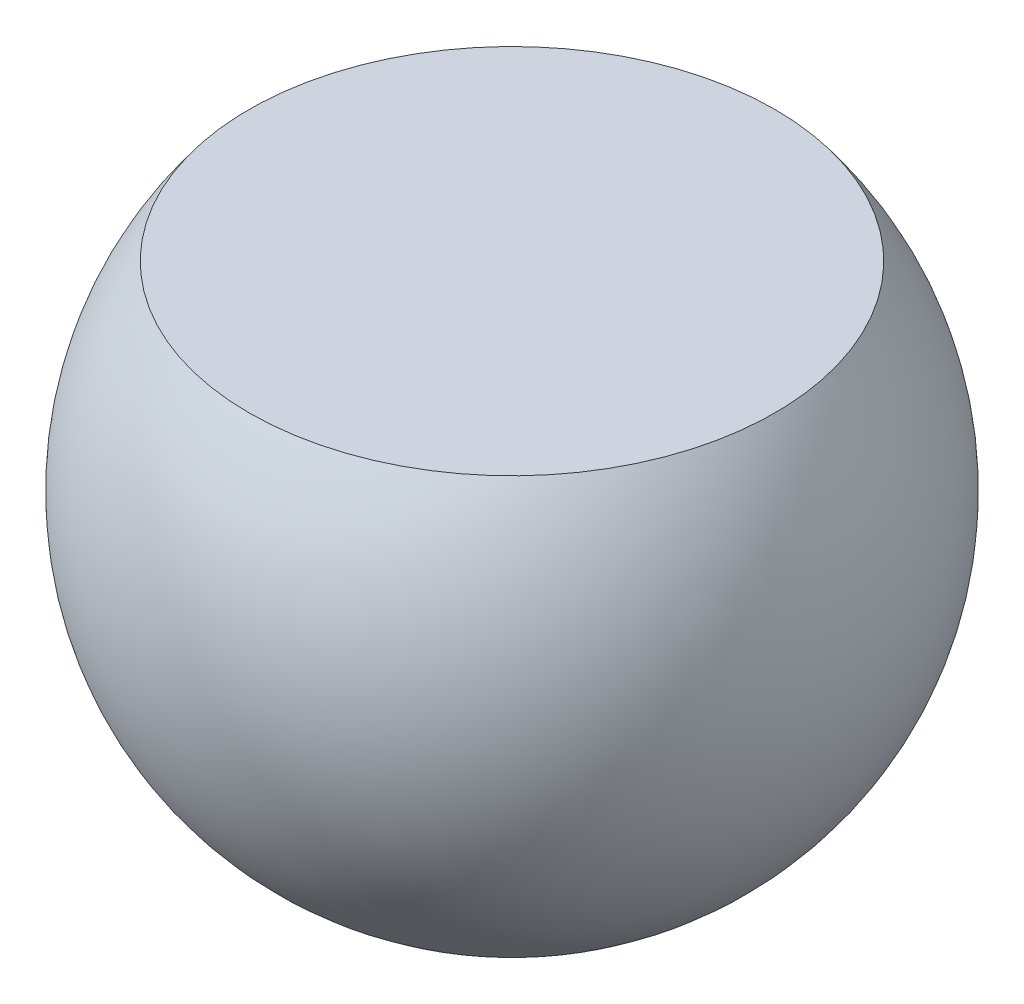
ISO-10303-21;
HEADER;
FILE_DESCRIPTION(('STEP AP214'),'2;1');
FILE_NAME('part.step','',(''),(''),'','','');
FILE_SCHEMA(('AUTOMOTIVE_DESIGN { 1 0 10303 214 1 1 1 1 }'));
ENDSEC;
DATA;
#1=APPLICATION_CONTEXT('core data for automotive mechanical design processes');
#2=APPLICATION_PROTOCOL_DEFINITION('international standard','automotive_design',2000,#1);
#3=PRODUCT_CONTEXT('',#1,'mechanical');
#4=PRODUCT('Part','Part','',(#3));
#5=PRODUCT_RELATED_PRODUCT_CATEGORY('part','',(#4));
#6=PRODUCT_DEFINITION_FORMATION('','',#4);
#7=PRODUCT_DEFINITION_CONTEXT('part definition',#1,'design');
#8=PRODUCT_DEFINITION('design','',#6,#7);
#9=PRODUCT_DEFINITION_SHAPE('','',#8);
#10=(LENGTH_UNIT() NAMED_UNIT(*) SI_UNIT(.MILLI.,.METRE.));
#11=(NAMED_UNIT(*) PLANE_ANGLE_UNIT() SI_UNIT($,.RADIAN.));
#12=(NAMED_UNIT(*) SI_UNIT($,.STERADIAN.) SOLID_ANGLE_UNIT());
#13=UNCERTAINTY_MEASURE_WITH_UNIT(LENGTH_MEASURE(1.E-05),#10,'distance_accuracy_value','');
#14=(GEOMETRIC_REPRESENTATION_CONTEXT(3) GLOBAL_UNCERTAINTY_ASSIGNED_CONTEXT((#13)) GLOBAL_UNIT_ASSIGNED_CONTEXT((#10,
#11,#12)) REPRESENTATION_CONTEXT('',''));
#15=CARTESIAN_POINT('',(0.,0.,0.));
#16=DIRECTION('',(0.,0.,1.));
#17=DIRECTION('',(1.,0.,0.));
#18=AXIS2_PLACEMENT_3D('',#15,#16,#17);
#19=CARTESIAN_POINT('',(0.,0.,0.));
#20=DIRECTION('',(0.,0.,-1.));
#21=DIRECTION('',(1.,0.,0.));
#22=AXIS2_PLACEMENT_3D('',#19,#20,#21);
#23=SPHERICAL_SURFACE('',#22,1.682500064);
#24=CARTESIAN_POINT('',(0.,0.,0.));
#25=DIRECTION('',(0.,-1.,0.));
#26=DIRECTION('',(0.,0.,-1.));
#27=AXIS2_PLACEMENT_3D('',#24,#25,#26);
#28=SPHERICAL_SURFACE('',#27,1.682500064);
#29=CARTESIAN_POINT('',(0.,1.016,0.));
#30=DIRECTION('',(0.,-1.,0.));
#31=DIRECTION('',(0.,0.,-1.));
#32=AXIS2_PLACEMENT_3D('',#29,#30,#31);
#33=CIRCLE('',#32,1.34110046803362);
#34=CARTESIAN_POINT('',(0.,1.016,-1.34110046803362));
#35=VERTEX_POINT('',#34);
#36=EDGE_CURVE('E10',#35,#35,#33,.F.);
#37=ORIENTED_EDGE('',*,*,#36,.F.);
#38=EDGE_LOOP('',(#37));
#39=FACE_BOUND('',#38,.T.);
#40=ADVANCED_FACE('F32',(#39),#28,.T.);
#41=CARTESIAN_POINT('',(0.,1.016,0.));
#42=DIRECTION('',(0.,-1.,0.));
#43=DIRECTION('',(0.,0.,-1.));
#44=AXIS2_PLACEMENT_3D('',#41,#42,#43);
#45=PLANE('',#44);
#46=ORIENTED_EDGE('',*,*,#36,.T.);
#47=EDGE_LOOP('',(#46));
#48=FACE_BOUND('',#47,.T.);
#49=ADVANCED_FACE('F39',(#48),#45,.F.);
#50=CLOSED_SHELL('',(#40,#49));
#51=MANIFOLD_SOLID_BREP('B2',#50);
#52=ADVANCED_BREP_SHAPE_REPRESENTATION('',(#18,#51),#14);
#53=SHAPE_DEFINITION_REPRESENTATION(#9,#52);
ENDSEC;
END-ISO-10303-21;
